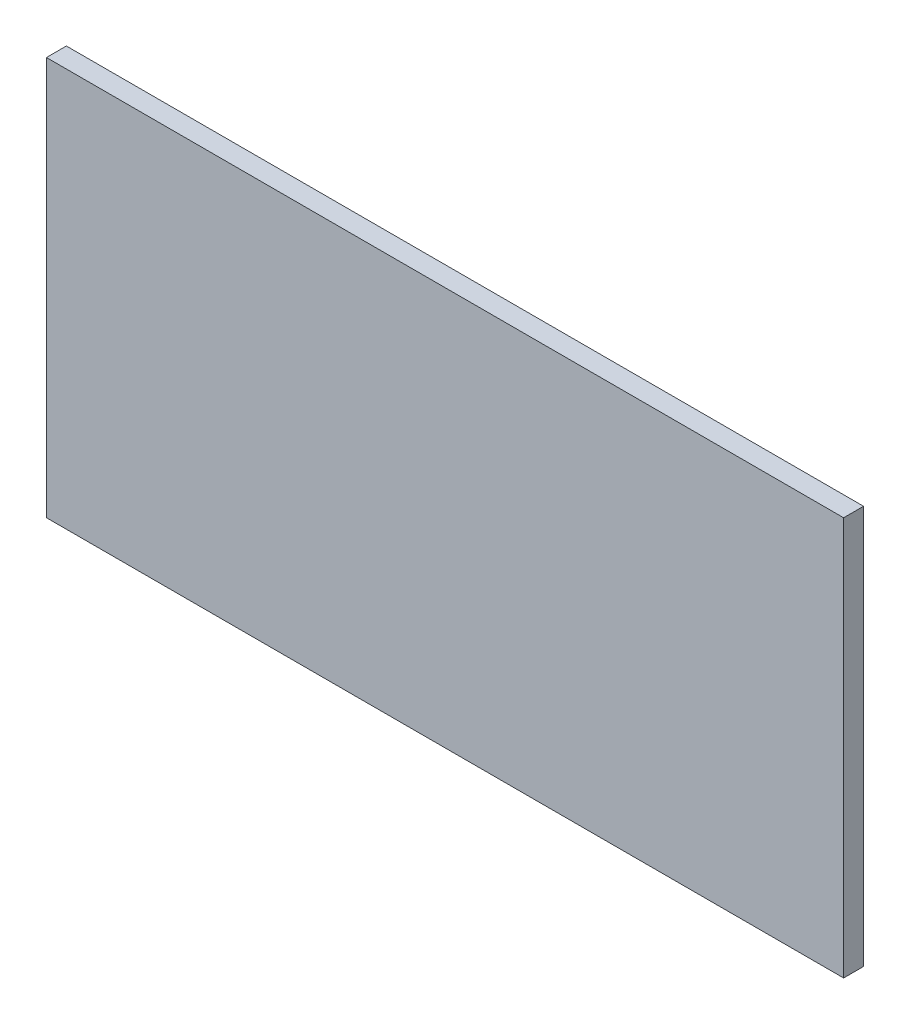
ISO-10303-21;
HEADER;
FILE_DESCRIPTION(('STEP AP214'),'2;1');
FILE_NAME('part.step','',(''),(''),'','','');
FILE_SCHEMA(('AUTOMOTIVE_DESIGN { 1 0 10303 214 1 1 1 1 }'));
ENDSEC;
DATA;
#1=APPLICATION_CONTEXT('core data for automotive mechanical design processes');
#2=APPLICATION_PROTOCOL_DEFINITION('international standard','automotive_design',2000,#1);
#3=PRODUCT_CONTEXT('',#1,'mechanical');
#4=PRODUCT('Part','Part','',(#3));
#5=PRODUCT_RELATED_PRODUCT_CATEGORY('part','',(#4));
#6=PRODUCT_DEFINITION_FORMATION('','',#4);
#7=PRODUCT_DEFINITION_CONTEXT('part definition',#1,'design');
#8=PRODUCT_DEFINITION('design','',#6,#7);
#9=PRODUCT_DEFINITION_SHAPE('','',#8);
#10=(LENGTH_UNIT() NAMED_UNIT(*) SI_UNIT(.MILLI.,.METRE.));
#11=(NAMED_UNIT(*) PLANE_ANGLE_UNIT() SI_UNIT($,.RADIAN.));
#12=(NAMED_UNIT(*) SI_UNIT($,.STERADIAN.) SOLID_ANGLE_UNIT());
#13=UNCERTAINTY_MEASURE_WITH_UNIT(LENGTH_MEASURE(1.E-05),#10,'distance_accuracy_value','');
#14=(GEOMETRIC_REPRESENTATION_CONTEXT(3) GLOBAL_UNCERTAINTY_ASSIGNED_CONTEXT((#13)) GLOBAL_UNIT_ASSIGNED_CONTEXT((#10,
#11,#12)) REPRESENTATION_CONTEXT('',''));
#15=CARTESIAN_POINT('',(0.,0.,0.));
#16=DIRECTION('',(0.,0.,1.));
#17=DIRECTION('',(1.,0.,0.));
#18=AXIS2_PLACEMENT_3D('',#15,#16,#17);
#19=CARTESIAN_POINT('',(-100.,-50.,5.));
#20=DIRECTION('',(1.,0.,0.));
#21=DIRECTION('',(0.,0.,-1.));
#22=AXIS2_PLACEMENT_3D('',#19,#20,#21);
#23=PLANE('',#22);
#24=DIRECTION('',(0.,-1.,0.));
#25=VECTOR('',#24,1.);
#26=CARTESIAN_POINT('',(-100.,-50.,0.));
#27=LINE('',#26,#25);
#28=CARTESIAN_POINT('',(-100.,50.,0.));
#29=VERTEX_POINT('',#28);
#30=CARTESIAN_POINT('',(-100.,-50.,0.));
#31=VERTEX_POINT('',#30);
#32=EDGE_CURVE('E96',#29,#31,#27,.T.);
#33=ORIENTED_EDGE('',*,*,#32,.T.);
#34=DIRECTION('',(0.,0.,-1.));
#35=VECTOR('',#34,1.);
#36=CARTESIAN_POINT('',(-100.,-50.,5.));
#37=LINE('',#36,#35);
#38=CARTESIAN_POINT('',(-100.,-50.,5.));
#39=VERTEX_POINT('',#38);
#40=EDGE_CURVE('E11',#39,#31,#37,.T.);
#41=ORIENTED_EDGE('',*,*,#40,.F.);
#42=DIRECTION('',(0.,-1.,0.));
#43=VECTOR('',#42,1.);
#44=CARTESIAN_POINT('',(-100.,-50.,5.));
#45=LINE('',#44,#43);
#46=CARTESIAN_POINT('',(-100.,50.,5.));
#47=VERTEX_POINT('',#46);
#48=EDGE_CURVE('E84',#47,#39,#45,.T.);
#49=ORIENTED_EDGE('',*,*,#48,.F.);
#50=DIRECTION('',(0.,0.,-1.));
#51=VECTOR('',#50,1.);
#52=CARTESIAN_POINT('',(-100.,50.,5.));
#53=LINE('',#52,#51);
#54=EDGE_CURVE('E92',#47,#29,#53,.T.);
#55=ORIENTED_EDGE('',*,*,#54,.T.);
#56=EDGE_LOOP('',(#33,#41,#49,#55));
#57=FACE_BOUND('',#56,.T.);
#58=ADVANCED_FACE('F33',(#57),#23,.F.);
#59=CARTESIAN_POINT('',(100.,-50.,5.));
#60=DIRECTION('',(0.,1.,0.));
#61=DIRECTION('',(-1.,0.,0.));
#62=AXIS2_PLACEMENT_3D('',#59,#60,#61);
#63=PLANE('',#62);
#64=DIRECTION('',(1.,0.,0.));
#65=VECTOR('',#64,1.);
#66=CARTESIAN_POINT('',(100.,-50.,0.));
#67=LINE('',#66,#65);
#68=CARTESIAN_POINT('',(100.,-50.,0.));
#69=VERTEX_POINT('',#68);
#70=EDGE_CURVE('E88',#31,#69,#67,.T.);
#71=ORIENTED_EDGE('',*,*,#70,.T.);
#72=DIRECTION('',(0.,0.,-1.));
#73=VECTOR('',#72,1.);
#74=CARTESIAN_POINT('',(100.,-50.,5.));
#75=LINE('',#74,#73);
#76=CARTESIAN_POINT('',(100.,-50.,5.));
#77=VERTEX_POINT('',#76);
#78=EDGE_CURVE('E41',#77,#69,#75,.T.);
#79=ORIENTED_EDGE('',*,*,#78,.F.);
#80=DIRECTION('',(1.,0.,0.));
#81=VECTOR('',#80,1.);
#82=CARTESIAN_POINT('',(100.,-50.,5.));
#83=LINE('',#82,#81);
#84=EDGE_CURVE('E79',#39,#77,#83,.T.);
#85=ORIENTED_EDGE('',*,*,#84,.F.);
#86=ORIENTED_EDGE('',*,*,#40,.T.);
#87=EDGE_LOOP('',(#71,#79,#85,#86));
#88=FACE_BOUND('',#87,.T.);
#89=ADVANCED_FACE('F87',(#88),#63,.F.);
#90=CARTESIAN_POINT('',(100.,-50.,5.));
#91=DIRECTION('',(-1.,0.,0.));
#92=DIRECTION('',(0.,0.,1.));
#93=AXIS2_PLACEMENT_3D('',#90,#91,#92);
#94=PLANE('',#93);
#95=DIRECTION('',(0.,1.,0.));
#96=VECTOR('',#95,1.);
#97=CARTESIAN_POINT('',(100.,-50.,0.));
#98=LINE('',#97,#96);
#99=CARTESIAN_POINT('',(100.,50.,0.));
#100=VERTEX_POINT('',#99);
#101=EDGE_CURVE('E66',#69,#100,#98,.T.);
#102=ORIENTED_EDGE('',*,*,#101,.T.);
#103=DIRECTION('',(0.,0.,-1.));
#104=VECTOR('',#103,1.);
#105=CARTESIAN_POINT('',(100.,50.,5.));
#106=LINE('',#105,#104);
#107=CARTESIAN_POINT('',(100.,50.,5.));
#108=VERTEX_POINT('',#107);
#109=EDGE_CURVE('E89',#108,#100,#106,.T.);
#110=ORIENTED_EDGE('',*,*,#109,.F.);
#111=DIRECTION('',(0.,1.,0.));
#112=VECTOR('',#111,1.);
#113=CARTESIAN_POINT('',(100.,-50.,5.));
#114=LINE('',#113,#112);
#115=EDGE_CURVE('E82',#77,#108,#114,.T.);
#116=ORIENTED_EDGE('',*,*,#115,.F.);
#117=ORIENTED_EDGE('',*,*,#78,.T.);
#118=EDGE_LOOP('',(#102,#110,#116,#117));
#119=FACE_BOUND('',#118,.T.);
#120=ADVANCED_FACE('F90',(#119),#94,.F.);
#121=CARTESIAN_POINT('',(100.,50.,5.));
#122=DIRECTION('',(0.,-1.,0.));
#123=DIRECTION('',(1.,0.,0.));
#124=AXIS2_PLACEMENT_3D('',#121,#122,#123);
#125=PLANE('',#124);
#126=DIRECTION('',(-1.,0.,0.));
#127=VECTOR('',#126,1.);
#128=CARTESIAN_POINT('',(100.,50.,0.));
#129=LINE('',#128,#127);
#130=EDGE_CURVE('E72',#100,#29,#129,.T.);
#131=ORIENTED_EDGE('',*,*,#130,.T.);
#132=ORIENTED_EDGE('',*,*,#54,.F.);
#133=DIRECTION('',(-1.,0.,0.));
#134=VECTOR('',#133,1.);
#135=CARTESIAN_POINT('',(100.,50.,5.));
#136=LINE('',#135,#134);
#137=EDGE_CURVE('E49',#108,#47,#136,.T.);
#138=ORIENTED_EDGE('',*,*,#137,.F.);
#139=ORIENTED_EDGE('',*,*,#109,.T.);
#140=EDGE_LOOP('',(#131,#132,#138,#139));
#141=FACE_BOUND('',#140,.T.);
#142=ADVANCED_FACE('F103',(#141),#125,.F.);
#143=CARTESIAN_POINT('',(0.,0.,5.));
#144=DIRECTION('',(0.,0.,1.));
#145=DIRECTION('',(1.,0.,0.));
#146=AXIS2_PLACEMENT_3D('',#143,#144,#145);
#147=PLANE('',#146);
#148=ORIENTED_EDGE('',*,*,#48,.T.);
#149=ORIENTED_EDGE('',*,*,#84,.T.);
#150=ORIENTED_EDGE('',*,*,#115,.T.);
#151=ORIENTED_EDGE('',*,*,#137,.T.);
#152=EDGE_LOOP('',(#148,#149,#150,#151));
#153=FACE_BOUND('',#152,.T.);
#154=ADVANCED_FACE('F80',(#153),#147,.T.);
#155=CARTESIAN_POINT('',(0.,0.,0.));
#156=DIRECTION('',(0.,0.,1.));
#157=DIRECTION('',(1.,0.,0.));
#158=AXIS2_PLACEMENT_3D('',#155,#156,#157);
#159=PLANE('',#158);
#160=ORIENTED_EDGE('',*,*,#32,.F.);
#161=ORIENTED_EDGE('',*,*,#130,.F.);
#162=ORIENTED_EDGE('',*,*,#101,.F.);
#163=ORIENTED_EDGE('',*,*,#70,.F.);
#164=EDGE_LOOP('',(#160,#161,#162,#163));
#165=FACE_BOUND('',#164,.T.);
#166=ADVANCED_FACE('F106',(#165),#159,.F.);
#167=CLOSED_SHELL('',(#58,#89,#120,#142,#154,#166));
#168=MANIFOLD_SOLID_BREP('B2',#167);
#169=ADVANCED_BREP_SHAPE_REPRESENTATION('',(#18,#168),#14);
#170=SHAPE_DEFINITION_REPRESENTATION(#9,#169);
ENDSEC;
END-ISO-10303-21;
